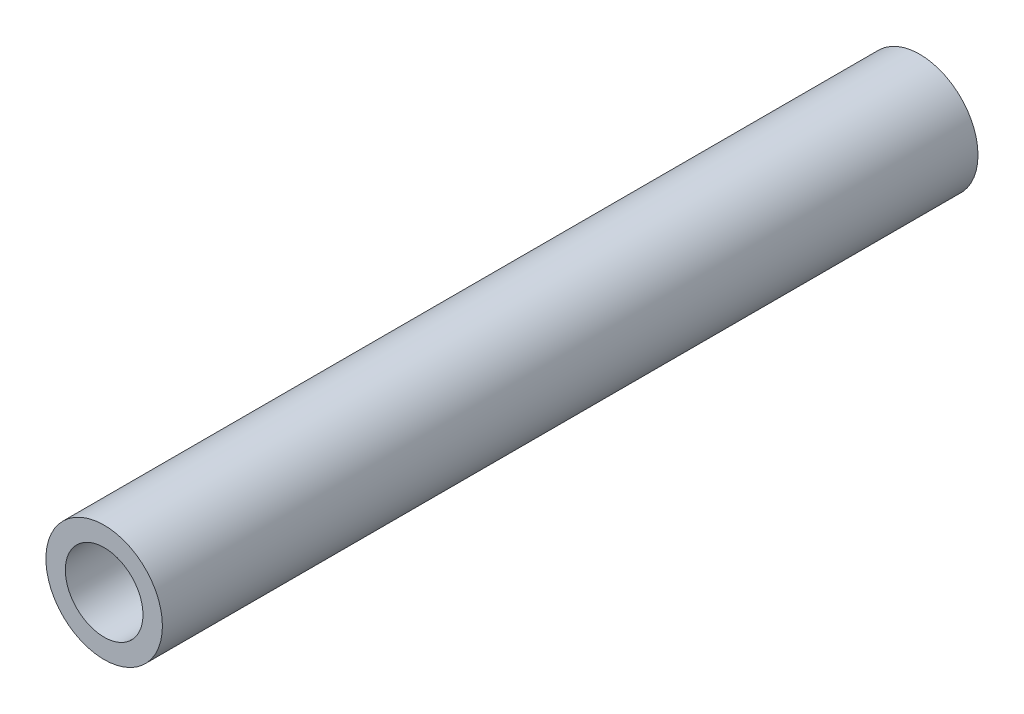
ISO-10303-21;
HEADER;
FILE_DESCRIPTION(('STEP AP214'),'2;1');
FILE_NAME('part.step','',(''),(''),'','','');
FILE_SCHEMA(('AUTOMOTIVE_DESIGN { 1 0 10303 214 1 1 1 1 }'));
ENDSEC;
DATA;
#1=APPLICATION_CONTEXT('core data for automotive mechanical design processes');
#2=APPLICATION_PROTOCOL_DEFINITION('international standard','automotive_design',2000,#1);
#3=PRODUCT_CONTEXT('',#1,'mechanical');
#4=PRODUCT('Part','Part','',(#3));
#5=PRODUCT_RELATED_PRODUCT_CATEGORY('part','',(#4));
#6=PRODUCT_DEFINITION_FORMATION('','',#4);
#7=PRODUCT_DEFINITION_CONTEXT('part definition',#1,'design');
#8=PRODUCT_DEFINITION('design','',#6,#7);
#9=PRODUCT_DEFINITION_SHAPE('','',#8);
#10=(LENGTH_UNIT() NAMED_UNIT(*) SI_UNIT(.MILLI.,.METRE.));
#11=(NAMED_UNIT(*) PLANE_ANGLE_UNIT() SI_UNIT($,.RADIAN.));
#12=(NAMED_UNIT(*) SI_UNIT($,.STERADIAN.) SOLID_ANGLE_UNIT());
#13=UNCERTAINTY_MEASURE_WITH_UNIT(LENGTH_MEASURE(1.E-05),#10,'distance_accuracy_value','');
#14=(GEOMETRIC_REPRESENTATION_CONTEXT(3) GLOBAL_UNCERTAINTY_ASSIGNED_CONTEXT((#13)) GLOBAL_UNIT_ASSIGNED_CONTEXT((#10,
#11,#12)) REPRESENTATION_CONTEXT('',''));
#15=CARTESIAN_POINT('',(0.,0.,0.));
#16=DIRECTION('',(0.,0.,1.));
#17=DIRECTION('',(1.,0.,0.));
#18=AXIS2_PLACEMENT_3D('',#15,#16,#17);
#19=CARTESIAN_POINT('',(0.,0.,21.));
#20=DIRECTION('',(0.,0.,1.));
#21=DIRECTION('',(1.,0.,0.));
#22=AXIS2_PLACEMENT_3D('',#19,#20,#21);
#23=PLANE('',#22);
#24=CARTESIAN_POINT('',(0.,0.,21.));
#25=DIRECTION('',(0.,0.,1.));
#26=DIRECTION('',(1.,0.,0.));
#27=AXIS2_PLACEMENT_3D('',#24,#25,#26);
#28=CIRCLE('',#27,1.5);
#29=CARTESIAN_POINT('',(1.5,0.,21.));
#30=VERTEX_POINT('',#29);
#31=EDGE_CURVE('E10',#30,#30,#28,.T.);
#32=ORIENTED_EDGE('',*,*,#31,.T.);
#33=EDGE_LOOP('',(#32));
#34=FACE_BOUND('',#33,.T.);
#35=CARTESIAN_POINT('',(0.,0.,21.));
#36=DIRECTION('',(0.,0.,1.));
#37=DIRECTION('',(1.,0.,0.));
#38=AXIS2_PLACEMENT_3D('',#35,#36,#37);
#39=CIRCLE('',#38,1.);
#40=CARTESIAN_POINT('',(1.,0.,21.));
#41=VERTEX_POINT('',#40);
#42=EDGE_CURVE('E43',#41,#41,#39,.T.);
#43=ORIENTED_EDGE('',*,*,#42,.F.);
#44=EDGE_LOOP('',(#43));
#45=FACE_BOUND('',#44,.T.);
#46=ADVANCED_FACE('F32',(#34,#45),#23,.T.);
#47=CARTESIAN_POINT('',(0.,0.,0.));
#48=DIRECTION('',(0.,0.,1.));
#49=DIRECTION('',(1.,0.,0.));
#50=AXIS2_PLACEMENT_3D('',#47,#48,#49);
#51=PLANE('',#50);
#52=CARTESIAN_POINT('',(0.,0.,0.));
#53=DIRECTION('',(0.,0.,1.));
#54=DIRECTION('',(1.,0.,0.));
#55=AXIS2_PLACEMENT_3D('',#52,#53,#54);
#56=CIRCLE('',#55,1.5);
#57=CARTESIAN_POINT('',(1.5,0.,0.));
#58=VERTEX_POINT('',#57);
#59=EDGE_CURVE('E36',#58,#58,#56,.T.);
#60=ORIENTED_EDGE('',*,*,#59,.F.);
#61=EDGE_LOOP('',(#60));
#62=FACE_BOUND('',#61,.T.);
#63=CARTESIAN_POINT('',(0.,0.,0.));
#64=DIRECTION('',(0.,0.,1.));
#65=DIRECTION('',(1.,0.,0.));
#66=AXIS2_PLACEMENT_3D('',#63,#64,#65);
#67=CIRCLE('',#66,1.);
#68=CARTESIAN_POINT('',(1.,0.,0.));
#69=VERTEX_POINT('',#68);
#70=EDGE_CURVE('E45',#69,#69,#67,.T.);
#71=ORIENTED_EDGE('',*,*,#70,.T.);
#72=EDGE_LOOP('',(#71));
#73=FACE_BOUND('',#72,.T.);
#74=ADVANCED_FACE('F55',(#62,#73),#51,.F.);
#75=CARTESIAN_POINT('',(0.,0.,21.));
#76=DIRECTION('',(0.,0.,-1.));
#77=DIRECTION('',(-1.,0.,0.));
#78=AXIS2_PLACEMENT_3D('',#75,#76,#77);
#79=CYLINDRICAL_SURFACE('',#78,1.5);
#80=ORIENTED_EDGE('',*,*,#31,.F.);
#81=EDGE_LOOP('',(#80));
#82=FACE_BOUND('',#81,.T.);
#83=ORIENTED_EDGE('',*,*,#59,.T.);
#84=EDGE_LOOP('',(#83));
#85=FACE_BOUND('',#84,.T.);
#86=ADVANCED_FACE('F34',(#82,#85),#79,.T.);
#87=CARTESIAN_POINT('',(0.,0.,21.));
#88=DIRECTION('',(0.,0.,-1.));
#89=DIRECTION('',(-1.,0.,0.));
#90=AXIS2_PLACEMENT_3D('',#87,#88,#89);
#91=CYLINDRICAL_SURFACE('',#90,1.);
#92=ORIENTED_EDGE('',*,*,#42,.T.);
#93=EDGE_LOOP('',(#92));
#94=FACE_BOUND('',#93,.T.);
#95=ORIENTED_EDGE('',*,*,#70,.F.);
#96=EDGE_LOOP('',(#95));
#97=FACE_BOUND('',#96,.T.);
#98=ADVANCED_FACE('F51',(#94,#97),#91,.F.);
#99=CLOSED_SHELL('',(#46,#74,#86,#98));
#100=MANIFOLD_SOLID_BREP('B2',#99);
#101=ADVANCED_BREP_SHAPE_REPRESENTATION('',(#18,#100),#14);
#102=SHAPE_DEFINITION_REPRESENTATION(#9,#101);
ENDSEC;
END-ISO-10303-21;
